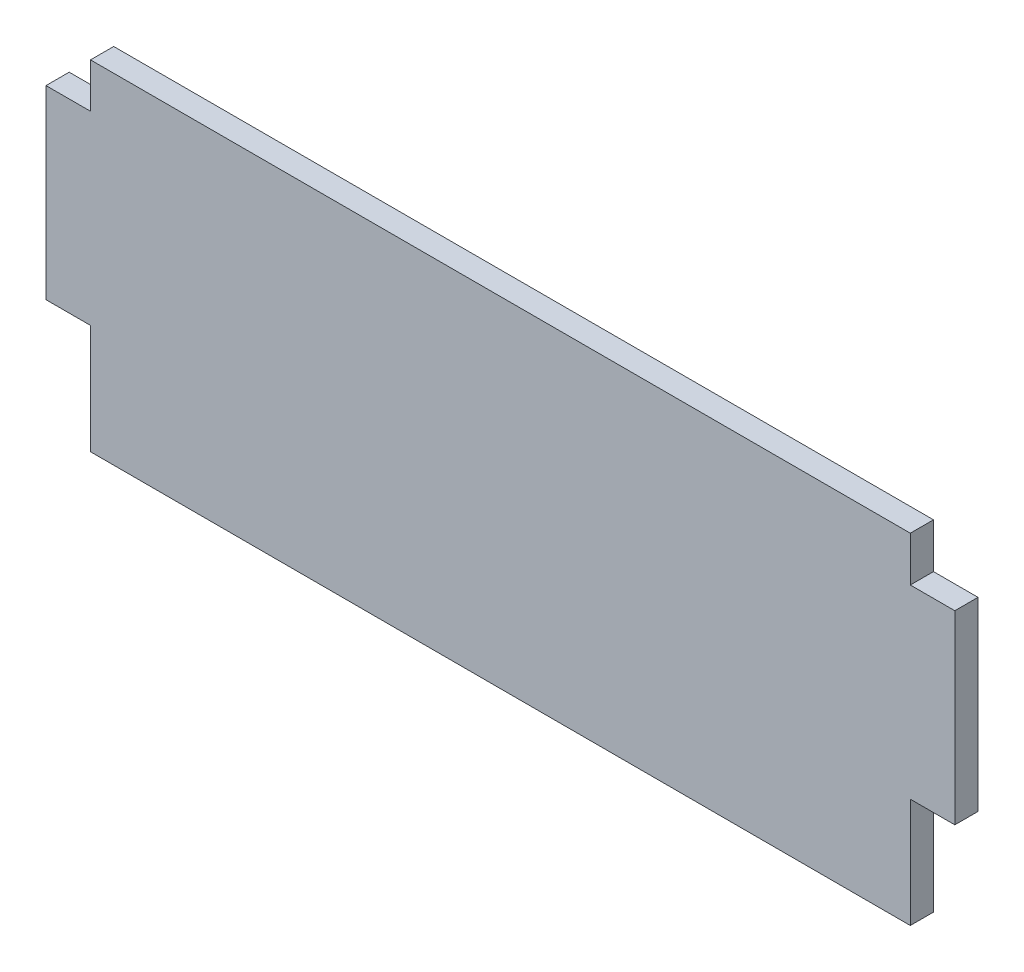
ISO-10303-21;
HEADER;
FILE_DESCRIPTION(('STEP AP214'),'2;1');
FILE_NAME('part.step','',(''),(''),'','','');
FILE_SCHEMA(('AUTOMOTIVE_DESIGN { 1 0 10303 214 1 1 1 1 }'));
ENDSEC;
DATA;
#1=APPLICATION_CONTEXT('core data for automotive mechanical design processes');
#2=APPLICATION_PROTOCOL_DEFINITION('international standard','automotive_design',2000,#1);
#3=PRODUCT_CONTEXT('',#1,'mechanical');
#4=PRODUCT('Part','Part','',(#3));
#5=PRODUCT_RELATED_PRODUCT_CATEGORY('part','',(#4));
#6=PRODUCT_DEFINITION_FORMATION('','',#4);
#7=PRODUCT_DEFINITION_CONTEXT('part definition',#1,'design');
#8=PRODUCT_DEFINITION('design','',#6,#7);
#9=PRODUCT_DEFINITION_SHAPE('','',#8);
#10=(LENGTH_UNIT() NAMED_UNIT(*) SI_UNIT(.MILLI.,.METRE.));
#11=(NAMED_UNIT(*) PLANE_ANGLE_UNIT() SI_UNIT($,.RADIAN.));
#12=(NAMED_UNIT(*) SI_UNIT($,.STERADIAN.) SOLID_ANGLE_UNIT());
#13=UNCERTAINTY_MEASURE_WITH_UNIT(LENGTH_MEASURE(1.E-05),#10,'distance_accuracy_value','');
#14=(GEOMETRIC_REPRESENTATION_CONTEXT(3) GLOBAL_UNCERTAINTY_ASSIGNED_CONTEXT((#13)) GLOBAL_UNIT_ASSIGNED_CONTEXT((#10,
#11,#12)) REPRESENTATION_CONTEXT('',''));
#15=CARTESIAN_POINT('',(0.,0.,0.));
#16=DIRECTION('',(0.,0.,1.));
#17=DIRECTION('',(1.,0.,0.));
#18=AXIS2_PLACEMENT_3D('',#15,#16,#17);
#19=CARTESIAN_POINT('',(0.,88.0110012367368,1.5875));
#20=DIRECTION('',(1.,0.,0.));
#21=DIRECTION('',(0.,0.,-1.));
#22=AXIS2_PLACEMENT_3D('',#19,#20,#21);
#23=PLANE('',#22);
#24=DIRECTION('',(0.,-1.,0.));
#25=VECTOR('',#24,1.);
#26=CARTESIAN_POINT('',(0.,88.0110012367368,0.));
#27=LINE('',#26,#25);
#28=CARTESIAN_POINT('',(0.,91.0589965060353,0.));
#29=VERTEX_POINT('',#28);
#30=CARTESIAN_POINT('',(0.,88.0110012367368,0.));
#31=VERTEX_POINT('',#30);
#32=EDGE_CURVE('E153',#29,#31,#27,.T.);
#33=ORIENTED_EDGE('',*,*,#32,.T.);
#34=DIRECTION('',(0.,0.,-1.));
#35=VECTOR('',#34,1.);
#36=CARTESIAN_POINT('',(0.,88.0110012367368,1.5875));
#37=LINE('',#36,#35);
#38=CARTESIAN_POINT('',(0.,88.0110012367368,1.5875));
#39=VERTEX_POINT('',#38);
#40=EDGE_CURVE('E11',#39,#31,#37,.T.);
#41=ORIENTED_EDGE('',*,*,#40,.F.);
#42=DIRECTION('',(0.,-1.,0.));
#43=VECTOR('',#42,1.);
#44=CARTESIAN_POINT('',(0.,88.0110012367368,1.5875));
#45=LINE('',#44,#43);
#46=CARTESIAN_POINT('',(0.,91.0589965060353,1.5875));
#47=VERTEX_POINT('',#46);
#48=EDGE_CURVE('E175',#47,#39,#45,.T.);
#49=ORIENTED_EDGE('',*,*,#48,.F.);
#50=DIRECTION('',(0.,0.,-1.));
#51=VECTOR('',#50,1.);
#52=CARTESIAN_POINT('',(0.,91.0589965060353,1.5875));
#53=LINE('',#52,#51);
#54=EDGE_CURVE('E149',#47,#29,#53,.T.);
#55=ORIENTED_EDGE('',*,*,#54,.T.);
#56=EDGE_LOOP('',(#33,#41,#49,#55));
#57=FACE_BOUND('',#56,.T.);
#58=ADVANCED_FACE('F33',(#57),#23,.F.);
#59=CARTESIAN_POINT('',(0.,88.0110012367368,1.5875));
#60=DIRECTION('',(0.,-1.,0.));
#61=DIRECTION('',(0.,0.,-1.));
#62=AXIS2_PLACEMENT_3D('',#59,#60,#61);
#63=PLANE('',#62);
#64=DIRECTION('',(-1.,0.,0.));
#65=VECTOR('',#64,1.);
#66=CARTESIAN_POINT('',(0.,88.0110012367368,0.));
#67=LINE('',#66,#65);
#68=CARTESIAN_POINT('',(-3.048,88.0110012367368,0.));
#69=VERTEX_POINT('',#68);
#70=EDGE_CURVE('E156',#31,#69,#67,.T.);
#71=ORIENTED_EDGE('',*,*,#70,.T.);
#72=DIRECTION('',(0.,0.,-1.));
#73=VECTOR('',#72,1.);
#74=CARTESIAN_POINT('',(-3.048,88.0110012367368,1.5875));
#75=LINE('',#74,#73);
#76=CARTESIAN_POINT('',(-3.048,88.0110012367368,1.5875));
#77=VERTEX_POINT('',#76);
#78=EDGE_CURVE('E41',#77,#69,#75,.T.);
#79=ORIENTED_EDGE('',*,*,#78,.F.);
#80=DIRECTION('',(-1.,0.,0.));
#81=VECTOR('',#80,1.);
#82=CARTESIAN_POINT('',(0.,88.0110012367368,1.5875));
#83=LINE('',#82,#81);
#84=EDGE_CURVE('E104',#39,#77,#83,.T.);
#85=ORIENTED_EDGE('',*,*,#84,.F.);
#86=ORIENTED_EDGE('',*,*,#40,.T.);
#87=EDGE_LOOP('',(#71,#79,#85,#86));
#88=FACE_BOUND('',#87,.T.);
#89=ADVANCED_FACE('F253',(#88),#63,.F.);
#90=CARTESIAN_POINT('',(-3.048,88.0110012367368,1.5875));
#91=DIRECTION('',(1.,0.,0.));
#92=DIRECTION('',(0.,0.,-1.));
#93=AXIS2_PLACEMENT_3D('',#90,#91,#92);
#94=PLANE('',#93);
#95=DIRECTION('',(0.,-1.,0.));
#96=VECTOR('',#95,1.);
#97=CARTESIAN_POINT('',(-3.048,88.0110012367368,0.));
#98=LINE('',#97,#96);
#99=CARTESIAN_POINT('',(-3.048,75.3110023215413,0.));
#100=VERTEX_POINT('',#99);
#101=EDGE_CURVE('E158',#69,#100,#98,.T.);
#102=ORIENTED_EDGE('',*,*,#101,.T.);
#103=DIRECTION('',(0.,0.,-1.));
#104=VECTOR('',#103,1.);
#105=CARTESIAN_POINT('',(-3.048,75.3110023215413,1.5875));
#106=LINE('',#105,#104);
#107=CARTESIAN_POINT('',(-3.048,75.3110023215413,1.5875));
#108=VERTEX_POINT('',#107);
#109=EDGE_CURVE('E194',#108,#100,#106,.T.);
#110=ORIENTED_EDGE('',*,*,#109,.F.);
#111=DIRECTION('',(0.,-1.,0.));
#112=VECTOR('',#111,1.);
#113=CARTESIAN_POINT('',(-3.048,88.0110012367368,1.5875));
#114=LINE('',#113,#112);
#115=EDGE_CURVE('E202',#77,#108,#114,.T.);
#116=ORIENTED_EDGE('',*,*,#115,.F.);
#117=ORIENTED_EDGE('',*,*,#78,.T.);
#118=EDGE_LOOP('',(#102,#110,#116,#117));
#119=FACE_BOUND('',#118,.T.);
#120=ADVANCED_FACE('F200',(#119),#94,.F.);
#121=CARTESIAN_POINT('',(-3.048,75.3110023215413,1.5875));
#122=DIRECTION('',(0.,1.,0.));
#123=DIRECTION('',(0.,0.,1.));
#124=AXIS2_PLACEMENT_3D('',#121,#122,#123);
#125=PLANE('',#124);
#126=DIRECTION('',(1.,0.,0.));
#127=VECTOR('',#126,1.);
#128=CARTESIAN_POINT('',(-3.048,75.3110023215413,0.));
#129=LINE('',#128,#127);
#130=CARTESIAN_POINT('',(0.,75.3110023215413,0.));
#131=VERTEX_POINT('',#130);
#132=EDGE_CURVE('E160',#100,#131,#129,.T.);
#133=ORIENTED_EDGE('',*,*,#132,.T.);
#134=DIRECTION('',(0.,0.,-1.));
#135=VECTOR('',#134,1.);
#136=CARTESIAN_POINT('',(0.,75.3110023215413,1.5875));
#137=LINE('',#136,#135);
#138=CARTESIAN_POINT('',(0.,75.3110023215413,1.5875));
#139=VERTEX_POINT('',#138);
#140=EDGE_CURVE('E191',#139,#131,#137,.T.);
#141=ORIENTED_EDGE('',*,*,#140,.F.);
#142=DIRECTION('',(1.,0.,0.));
#143=VECTOR('',#142,1.);
#144=CARTESIAN_POINT('',(-3.048,75.3110023215413,1.5875));
#145=LINE('',#144,#143);
#146=EDGE_CURVE('E220',#108,#139,#145,.T.);
#147=ORIENTED_EDGE('',*,*,#146,.F.);
#148=ORIENTED_EDGE('',*,*,#109,.T.);
#149=EDGE_LOOP('',(#133,#141,#147,#148));
#150=FACE_BOUND('',#149,.T.);
#151=ADVANCED_FACE('F211',(#150),#125,.F.);
#152=CARTESIAN_POINT('',(0.,75.3110023215413,1.5875));
#153=DIRECTION('',(1.,0.,0.));
#154=DIRECTION('',(0.,0.,-1.));
#155=AXIS2_PLACEMENT_3D('',#152,#153,#154);
#156=PLANE('',#155);
#157=DIRECTION('',(0.,-1.,0.));
#158=VECTOR('',#157,1.);
#159=CARTESIAN_POINT('',(0.,75.3110023215413,0.));
#160=LINE('',#159,#158);
#161=CARTESIAN_POINT('',(0.,67.8179981186986,0.));
#162=VERTEX_POINT('',#161);
#163=EDGE_CURVE('E162',#131,#162,#160,.T.);
#164=ORIENTED_EDGE('',*,*,#163,.T.);
#165=DIRECTION('',(0.,0.,-1.));
#166=VECTOR('',#165,1.);
#167=CARTESIAN_POINT('',(0.,67.8179981186986,1.5875));
#168=LINE('',#167,#166);
#169=CARTESIAN_POINT('',(0.,67.8179981186986,1.5875));
#170=VERTEX_POINT('',#169);
#171=EDGE_CURVE('E188',#170,#162,#168,.T.);
#172=ORIENTED_EDGE('',*,*,#171,.F.);
#173=DIRECTION('',(0.,-1.,0.));
#174=VECTOR('',#173,1.);
#175=CARTESIAN_POINT('',(0.,75.3110023215413,1.5875));
#176=LINE('',#175,#174);
#177=EDGE_CURVE('E217',#139,#170,#176,.T.);
#178=ORIENTED_EDGE('',*,*,#177,.F.);
#179=ORIENTED_EDGE('',*,*,#140,.T.);
#180=EDGE_LOOP('',(#164,#172,#178,#179));
#181=FACE_BOUND('',#180,.T.);
#182=ADVANCED_FACE('F215',(#181),#156,.F.);
#183=CARTESIAN_POINT('',(56.1340003464818,67.7925916388631,1.5875));
#184=DIRECTION('',(0.000452604073759694,0.999999897574771,0.));
#185=DIRECTION('',(-0.999999897574771,0.000452604073759694,0.));
#186=AXIS2_PLACEMENT_3D('',#183,#184,#185);
#187=PLANE('',#186);
#188=DIRECTION('',(0.999999897574771,-0.000452604073759694,0.));
#189=VECTOR('',#188,1.);
#190=CARTESIAN_POINT('',(56.1340003464818,67.7925916388631,0.));
#191=LINE('',#190,#189);
#192=CARTESIAN_POINT('',(56.1340003464818,67.7925916388631,0.));
#193=VERTEX_POINT('',#192);
#194=EDGE_CURVE('E164',#162,#193,#191,.T.);
#195=ORIENTED_EDGE('',*,*,#194,.T.);
#196=DIRECTION('',(0.,0.,-1.));
#197=VECTOR('',#196,1.);
#198=CARTESIAN_POINT('',(56.1340003464818,67.7925916388631,1.5875));
#199=LINE('',#198,#197);
#200=CARTESIAN_POINT('',(56.1340003464818,67.7925916388631,1.5875));
#201=VERTEX_POINT('',#200);
#202=EDGE_CURVE('E185',#201,#193,#199,.T.);
#203=ORIENTED_EDGE('',*,*,#202,.F.);
#204=DIRECTION('',(0.999999897574771,-0.000452604073759694,0.));
#205=VECTOR('',#204,1.);
#206=CARTESIAN_POINT('',(56.1340003464818,67.7925916388631,1.5875));
#207=LINE('',#206,#205);
#208=EDGE_CURVE('E219',#170,#201,#207,.T.);
#209=ORIENTED_EDGE('',*,*,#208,.F.);
#210=ORIENTED_EDGE('',*,*,#171,.T.);
#211=EDGE_LOOP('',(#195,#203,#209,#210));
#212=FACE_BOUND('',#211,.T.);
#213=ADVANCED_FACE('F266',(#212),#187,.F.);
#214=CARTESIAN_POINT('',(56.1340003464818,75.2855958417058,1.5875));
#215=DIRECTION('',(-1.,0.,0.));
#216=DIRECTION('',(0.,0.,1.));
#217=AXIS2_PLACEMENT_3D('',#214,#215,#216);
#218=PLANE('',#217);
#219=DIRECTION('',(0.,1.,0.));
#220=VECTOR('',#219,1.);
#221=CARTESIAN_POINT('',(56.1340003464818,75.2855958417058,0.));
#222=LINE('',#221,#220);
#223=CARTESIAN_POINT('',(56.1340003464818,75.2855958417058,0.));
#224=VERTEX_POINT('',#223);
#225=EDGE_CURVE('E166',#193,#224,#222,.T.);
#226=ORIENTED_EDGE('',*,*,#225,.T.);
#227=DIRECTION('',(0.,0.,-1.));
#228=VECTOR('',#227,1.);
#229=CARTESIAN_POINT('',(56.1340003464818,75.2855958417058,1.5875));
#230=LINE('',#229,#228);
#231=CARTESIAN_POINT('',(56.1340003464818,75.2855958417058,1.5875));
#232=VERTEX_POINT('',#231);
#233=EDGE_CURVE('E182',#232,#224,#230,.T.);
#234=ORIENTED_EDGE('',*,*,#233,.F.);
#235=DIRECTION('',(0.,1.,0.));
#236=VECTOR('',#235,1.);
#237=CARTESIAN_POINT('',(56.1340003464818,75.2855958417058,1.5875));
#238=LINE('',#237,#236);
#239=EDGE_CURVE('E222',#201,#232,#238,.T.);
#240=ORIENTED_EDGE('',*,*,#239,.F.);
#241=ORIENTED_EDGE('',*,*,#202,.T.);
#242=EDGE_LOOP('',(#226,#234,#240,#241));
#243=FACE_BOUND('',#242,.T.);
#244=ADVANCED_FACE('F269',(#243),#218,.F.);
#245=CARTESIAN_POINT('',(59.1820003464818,75.2855958417058,1.5875));
#246=DIRECTION('',(0.,1.,0.));
#247=DIRECTION('',(0.,0.,1.));
#248=AXIS2_PLACEMENT_3D('',#245,#246,#247);
#249=PLANE('',#248);
#250=DIRECTION('',(1.,0.,0.));
#251=VECTOR('',#250,1.);
#252=CARTESIAN_POINT('',(59.1820003464818,75.2855958417058,0.));
#253=LINE('',#252,#251);
#254=CARTESIAN_POINT('',(59.1820003464818,75.2855958417058,0.));
#255=VERTEX_POINT('',#254);
#256=EDGE_CURVE('E168',#224,#255,#253,.T.);
#257=ORIENTED_EDGE('',*,*,#256,.T.);
#258=DIRECTION('',(0.,0.,-1.));
#259=VECTOR('',#258,1.);
#260=CARTESIAN_POINT('',(59.1820003464818,75.2855958417058,1.5875));
#261=LINE('',#260,#259);
#262=CARTESIAN_POINT('',(59.1820003464818,75.2855958417058,1.5875));
#263=VERTEX_POINT('',#262);
#264=EDGE_CURVE('E179',#263,#255,#261,.T.);
#265=ORIENTED_EDGE('',*,*,#264,.F.);
#266=DIRECTION('',(1.,0.,0.));
#267=VECTOR('',#266,1.);
#268=CARTESIAN_POINT('',(59.1820003464818,75.2855958417058,1.5875));
#269=LINE('',#268,#267);
#270=EDGE_CURVE('E228',#232,#263,#269,.T.);
#271=ORIENTED_EDGE('',*,*,#270,.F.);
#272=ORIENTED_EDGE('',*,*,#233,.T.);
#273=EDGE_LOOP('',(#257,#265,#271,#272));
#274=FACE_BOUND('',#273,.T.);
#275=ADVANCED_FACE('F234',(#274),#249,.F.);
#276=CARTESIAN_POINT('',(59.1820003464818,87.9855947569013,1.5875));
#277=DIRECTION('',(-1.,0.,0.));
#278=DIRECTION('',(0.,0.,1.));
#279=AXIS2_PLACEMENT_3D('',#276,#277,#278);
#280=PLANE('',#279);
#281=DIRECTION('',(0.,1.,0.));
#282=VECTOR('',#281,1.);
#283=CARTESIAN_POINT('',(59.1820003464818,87.9855947569013,0.));
#284=LINE('',#283,#282);
#285=CARTESIAN_POINT('',(59.1820003464818,87.9855947569013,0.));
#286=VERTEX_POINT('',#285);
#287=EDGE_CURVE('E170',#255,#286,#284,.T.);
#288=ORIENTED_EDGE('',*,*,#287,.T.);
#289=DIRECTION('',(0.,0.,-1.));
#290=VECTOR('',#289,1.);
#291=CARTESIAN_POINT('',(59.1820003464818,87.9855947569013,1.5875));
#292=LINE('',#291,#290);
#293=CARTESIAN_POINT('',(59.1820003464818,87.9855947569013,1.5875));
#294=VERTEX_POINT('',#293);
#295=EDGE_CURVE('E144',#294,#286,#292,.T.);
#296=ORIENTED_EDGE('',*,*,#295,.F.);
#297=DIRECTION('',(0.,1.,0.));
#298=VECTOR('',#297,1.);
#299=CARTESIAN_POINT('',(59.1820003464818,87.9855947569013,1.5875));
#300=LINE('',#299,#298);
#301=EDGE_CURVE('E135',#263,#294,#300,.T.);
#302=ORIENTED_EDGE('',*,*,#301,.F.);
#303=ORIENTED_EDGE('',*,*,#264,.T.);
#304=EDGE_LOOP('',(#288,#296,#302,#303));
#305=FACE_BOUND('',#304,.T.);
#306=ADVANCED_FACE('F238',(#305),#280,.F.);
#307=CARTESIAN_POINT('',(56.1340003464818,87.9855947569013,1.5875));
#308=DIRECTION('',(0.,-1.,0.));
#309=DIRECTION('',(0.,0.,-1.));
#310=AXIS2_PLACEMENT_3D('',#307,#308,#309);
#311=PLANE('',#310);
#312=DIRECTION('',(-1.,0.,0.));
#313=VECTOR('',#312,1.);
#314=CARTESIAN_POINT('',(56.1340003464818,87.9855947569013,0.));
#315=LINE('',#314,#313);
#316=CARTESIAN_POINT('',(56.1340003464818,87.9855947569013,0.));
#317=VERTEX_POINT('',#316);
#318=EDGE_CURVE('E143',#286,#317,#315,.T.);
#319=ORIENTED_EDGE('',*,*,#318,.T.);
#320=DIRECTION('',(0.,0.,-1.));
#321=VECTOR('',#320,1.);
#322=CARTESIAN_POINT('',(56.1340003464818,87.9855947569013,1.5875));
#323=LINE('',#322,#321);
#324=CARTESIAN_POINT('',(56.1340003464818,87.9855947569013,1.5875));
#325=VERTEX_POINT('',#324);
#326=EDGE_CURVE('E140',#325,#317,#323,.T.);
#327=ORIENTED_EDGE('',*,*,#326,.F.);
#328=DIRECTION('',(-1.,0.,0.));
#329=VECTOR('',#328,1.);
#330=CARTESIAN_POINT('',(56.1340003464818,87.9855947569013,1.5875));
#331=LINE('',#330,#329);
#332=EDGE_CURVE('E129',#294,#325,#331,.T.);
#333=ORIENTED_EDGE('',*,*,#332,.F.);
#334=ORIENTED_EDGE('',*,*,#295,.T.);
#335=EDGE_LOOP('',(#319,#327,#333,#334));
#336=FACE_BOUND('',#335,.T.);
#337=ADVANCED_FACE('F141',(#336),#311,.F.);
#338=CARTESIAN_POINT('',(56.1340004205704,91.0589965060353,1.5875));
#339=DIRECTION('',(-1.,2.41063728926217E-08,0.));
#340=DIRECTION('',(-2.41063728926217E-08,-1.,0.));
#341=AXIS2_PLACEMENT_3D('',#338,#339,#340);
#342=PLANE('',#341);
#343=DIRECTION('',(2.41063728926217E-08,1.,0.));
#344=VECTOR('',#343,1.);
#345=CARTESIAN_POINT('',(56.1340004205704,91.0589965060353,0.));
#346=LINE('',#345,#344);
#347=CARTESIAN_POINT('',(56.1340004205704,91.0589965060353,0.));
#348=VERTEX_POINT('',#347);
#349=EDGE_CURVE('E90',#317,#348,#346,.T.);
#350=ORIENTED_EDGE('',*,*,#349,.T.);
#351=DIRECTION('',(0.,0.,-1.));
#352=VECTOR('',#351,1.);
#353=CARTESIAN_POINT('',(56.1340004205704,91.0589965060353,1.5875));
#354=LINE('',#353,#352);
#355=CARTESIAN_POINT('',(56.1340004205704,91.0589965060353,1.5875));
#356=VERTEX_POINT('',#355);
#357=EDGE_CURVE('E145',#356,#348,#354,.T.);
#358=ORIENTED_EDGE('',*,*,#357,.F.);
#359=DIRECTION('',(2.41063728926217E-08,1.,0.));
#360=VECTOR('',#359,1.);
#361=CARTESIAN_POINT('',(56.1340004205704,91.0589965060353,1.5875));
#362=LINE('',#361,#360);
#363=EDGE_CURVE('E133',#325,#356,#362,.T.);
#364=ORIENTED_EDGE('',*,*,#363,.F.);
#365=ORIENTED_EDGE('',*,*,#326,.T.);
#366=EDGE_LOOP('',(#350,#358,#364,#365));
#367=FACE_BOUND('',#366,.T.);
#368=ADVANCED_FACE('F147',(#367),#342,.F.);
#369=CARTESIAN_POINT('',(0.,91.0589965060353,1.5875));
#370=DIRECTION('',(0.,-1.,0.));
#371=DIRECTION('',(0.,0.,-1.));
#372=AXIS2_PLACEMENT_3D('',#369,#370,#371);
#373=PLANE('',#372);
#374=DIRECTION('',(-1.,0.,0.));
#375=VECTOR('',#374,1.);
#376=CARTESIAN_POINT('',(0.,91.0589965060353,0.));
#377=LINE('',#376,#375);
#378=EDGE_CURVE('E96',#348,#29,#377,.T.);
#379=ORIENTED_EDGE('',*,*,#378,.T.);
#380=ORIENTED_EDGE('',*,*,#54,.F.);
#381=DIRECTION('',(-1.,0.,0.));
#382=VECTOR('',#381,1.);
#383=CARTESIAN_POINT('',(0.,91.0589965060353,1.5875));
#384=LINE('',#383,#382);
#385=EDGE_CURVE('E49',#356,#47,#384,.T.);
#386=ORIENTED_EDGE('',*,*,#385,.F.);
#387=ORIENTED_EDGE('',*,*,#357,.T.);
#388=EDGE_LOOP('',(#379,#380,#386,#387));
#389=FACE_BOUND('',#388,.T.);
#390=ADVANCED_FACE('F242',(#389),#373,.F.);
#391=CARTESIAN_POINT('',(0.,0.,1.5875));
#392=DIRECTION('',(0.,0.,-1.));
#393=DIRECTION('',(-1.,0.,0.));
#394=AXIS2_PLACEMENT_3D('',#391,#392,#393);
#395=PLANE('',#394);
#396=ORIENTED_EDGE('',*,*,#48,.T.);
#397=ORIENTED_EDGE('',*,*,#84,.T.);
#398=ORIENTED_EDGE('',*,*,#115,.T.);
#399=ORIENTED_EDGE('',*,*,#146,.T.);
#400=ORIENTED_EDGE('',*,*,#177,.T.);
#401=ORIENTED_EDGE('',*,*,#208,.T.);
#402=ORIENTED_EDGE('',*,*,#239,.T.);
#403=ORIENTED_EDGE('',*,*,#270,.T.);
#404=ORIENTED_EDGE('',*,*,#301,.T.);
#405=ORIENTED_EDGE('',*,*,#332,.T.);
#406=ORIENTED_EDGE('',*,*,#363,.T.);
#407=ORIENTED_EDGE('',*,*,#385,.T.);
#408=EDGE_LOOP('',(#396,#397,#398,#399,#400,#401,#402,#403,#404,#405,#406,#407));
#409=FACE_BOUND('',#408,.T.);
#410=ADVANCED_FACE('F131',(#409),#395,.F.);
#411=CARTESIAN_POINT('',(0.,0.,0.));
#412=DIRECTION('',(0.,0.,-1.));
#413=DIRECTION('',(-1.,0.,0.));
#414=AXIS2_PLACEMENT_3D('',#411,#412,#413);
#415=PLANE('',#414);
#416=ORIENTED_EDGE('',*,*,#32,.F.);
#417=ORIENTED_EDGE('',*,*,#378,.F.);
#418=ORIENTED_EDGE('',*,*,#349,.F.);
#419=ORIENTED_EDGE('',*,*,#318,.F.);
#420=ORIENTED_EDGE('',*,*,#287,.F.);
#421=ORIENTED_EDGE('',*,*,#256,.F.);
#422=ORIENTED_EDGE('',*,*,#225,.F.);
#423=ORIENTED_EDGE('',*,*,#194,.F.);
#424=ORIENTED_EDGE('',*,*,#163,.F.);
#425=ORIENTED_EDGE('',*,*,#132,.F.);
#426=ORIENTED_EDGE('',*,*,#101,.F.);
#427=ORIENTED_EDGE('',*,*,#70,.F.);
#428=EDGE_LOOP('',(#416,#417,#418,#419,#420,#421,#422,#423,#424,#425,#426,#427));
#429=FACE_BOUND('',#428,.T.);
#430=ADVANCED_FACE('F206',(#429),#415,.T.);
#431=CLOSED_SHELL('',(#58,#89,#120,#151,#182,#213,#244,#275,#306,#337,#368,#390,#410,#430));
#432=MANIFOLD_SOLID_BREP('B2',#431);
#433=ADVANCED_BREP_SHAPE_REPRESENTATION('',(#18,#432),#14);
#434=SHAPE_DEFINITION_REPRESENTATION(#9,#433);
ENDSEC;
END-ISO-10303-21;
